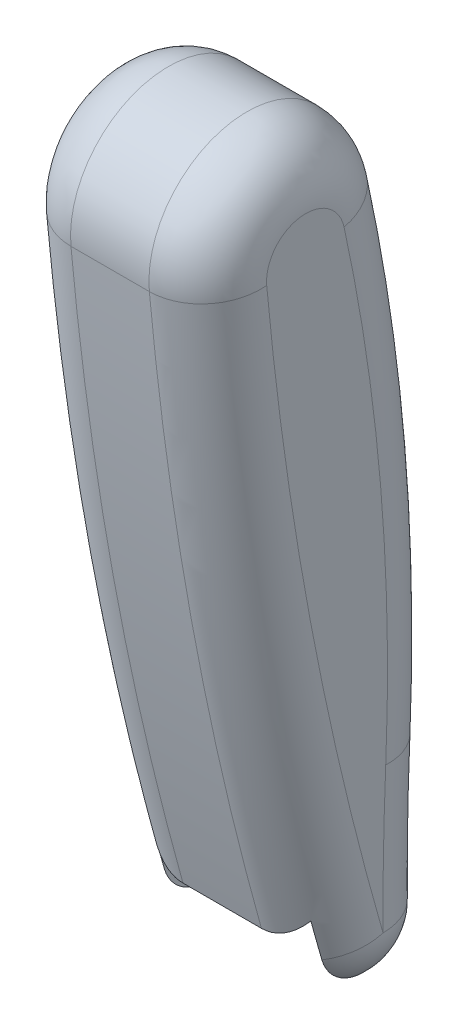
ISO-10303-21;
HEADER;
FILE_DESCRIPTION(('STEP AP214'),'2;1');
FILE_NAME('part.step','',(''),(''),'','','');
FILE_SCHEMA(('AUTOMOTIVE_DESIGN { 1 0 10303 214 1 1 1 1 }'));
ENDSEC;
DATA;
#1=APPLICATION_CONTEXT('core data for automotive mechanical design processes');
#2=APPLICATION_PROTOCOL_DEFINITION('international standard','automotive_design',2000,#1);
#3=PRODUCT_CONTEXT('',#1,'mechanical');
#4=PRODUCT('Part','Part','',(#3));
#5=PRODUCT_RELATED_PRODUCT_CATEGORY('part','',(#4));
#6=PRODUCT_DEFINITION_FORMATION('','',#4);
#7=PRODUCT_DEFINITION_CONTEXT('part definition',#1,'design');
#8=PRODUCT_DEFINITION('design','',#6,#7);
#9=PRODUCT_DEFINITION_SHAPE('','',#8);
#10=(LENGTH_UNIT() NAMED_UNIT(*) SI_UNIT(.MILLI.,.METRE.));
#11=(NAMED_UNIT(*) PLANE_ANGLE_UNIT() SI_UNIT($,.RADIAN.));
#12=(NAMED_UNIT(*) SI_UNIT($,.STERADIAN.) SOLID_ANGLE_UNIT());
#13=UNCERTAINTY_MEASURE_WITH_UNIT(LENGTH_MEASURE(1.E-05),#10,'distance_accuracy_value','');
#14=(GEOMETRIC_REPRESENTATION_CONTEXT(3) GLOBAL_UNCERTAINTY_ASSIGNED_CONTEXT((#13)) GLOBAL_UNIT_ASSIGNED_CONTEXT((#10,
#11,#12)) REPRESENTATION_CONTEXT('',''));
#15=CARTESIAN_POINT('',(0.,0.,0.));
#16=DIRECTION('',(0.,0.,1.));
#17=DIRECTION('',(1.,0.,0.));
#18=AXIS2_PLACEMENT_3D('',#15,#16,#17);
#19=CARTESIAN_POINT('',(139.699999999998,-1012.18416138642,1203.08834154745));
#20=DIRECTION('',(-1.,0.,0.));
#21=DIRECTION('',(0.,0.,1.));
#22=AXIS2_PLACEMENT_3D('',#19,#20,#21);
#23=TOROIDAL_SURFACE('',#22,1231.9,38.1);
#24=CARTESIAN_POINT('',(139.699999999999,-750.312913689883,-0.656257455955545));
#25=DIRECTION('',(0.,0.97714473496499,0.212575085393842));
#26=DIRECTION('',(0.,0.212575085393842,-0.97714473496499));
#27=AXIS2_PLACEMENT_3D('',#24,#25,#26);
#28=CIRCLE('',#27,38.1000000000001);
#29=CARTESIAN_POINT('',(177.8,-750.312913689885,-0.656257455955741));
#30=VERTEX_POINT('',#29);
#31=CARTESIAN_POINT('',(139.7,-742.213802936382,-37.8854718581219));
#32=VERTEX_POINT('',#31);
#33=EDGE_CURVE('E254',#30,#32,#28,.T.);
#34=ORIENTED_EDGE('',*,*,#33,.F.);
#35=CARTESIAN_POINT('',(177.799999999998,-1012.18416138642,1203.08834154745));
#36=DIRECTION('',(-1.,0.,0.));
#37=DIRECTION('',(0.,0.,1.));
#38=AXIS2_PLACEMENT_3D('',#35,#36,#37);
#39=CIRCLE('',#38,1231.9);
#40=CARTESIAN_POINT('',(177.799999999964,-1065.63335894836,-27.6515957585587));
#41=VERTEX_POINT('',#40);
#42=EDGE_CURVE('E424',#41,#30,#39,.F.);
#43=ORIENTED_EDGE('',*,*,#42,.F.);
#44=CARTESIAN_POINT('',(139.7,-1065.63335894836,-27.6515957585584));
#45=DIRECTION('',(0.,-0.999058314234925,0.0433876106517766));
#46=DIRECTION('',(0.,-0.0433876106517766,-0.999058314234925));
#47=AXIS2_PLACEMENT_3D('',#44,#45,#46);
#48=CIRCLE('',#47,38.1);
#49=CARTESIAN_POINT('',(139.7,-1067.28642691419,-65.7157175309086));
#50=VERTEX_POINT('',#49);
#51=EDGE_CURVE('E407',#50,#41,#48,.T.);
#52=ORIENTED_EDGE('',*,*,#51,.F.);
#53=CARTESIAN_POINT('',(139.7,-1012.18416138642,1203.08834154745));
#54=DIRECTION('',(-1.,0.,0.));
#55=DIRECTION('',(0.,0.,1.));
#56=AXIS2_PLACEMENT_3D('',#53,#54,#55);
#57=CIRCLE('',#56,1270.);
#58=EDGE_CURVE('E251',#32,#50,#57,.T.);
#59=ORIENTED_EDGE('',*,*,#58,.F.);
#60=EDGE_LOOP('',(#34,#43,#52,#59));
#61=FACE_BOUND('',#60,.T.);
#62=ADVANCED_FACE('F16',(#61),#23,.T.);
#63=CARTESIAN_POINT('',(139.699999999823,-1147.29470222544,-1908.01427826088));
#64=DIRECTION('',(-1.,0.,0.));
#65=DIRECTION('',(0.,0.,1.));
#66=AXIS2_PLACEMENT_3D('',#63,#64,#65);
#67=TOROIDAL_SURFACE('',#66,1882.13506229844,38.1);
#68=CARTESIAN_POINT('',(139.7,-1147.29470222544,-1908.01427826088));
#69=DIRECTION('',(-1.,0.,0.));
#70=DIRECTION('',(0.,0.,1.));
#71=AXIS2_PLACEMENT_3D('',#68,#69,#70);
#72=CIRCLE('',#71,1844.03506229844);
#73=CARTESIAN_POINT('',(139.7,-1143.77779359425,-63.9825696561486));
#74=VERTEX_POINT('',#73);
#75=EDGE_CURVE('E238',#74,#50,#72,.T.);
#76=ORIENTED_EDGE('',*,*,#75,.T.);
#77=ORIENTED_EDGE('',*,*,#51,.T.);
#78=CARTESIAN_POINT('',(177.799999999823,-1147.29470222544,-1908.01427826089));
#79=DIRECTION('',(-1.,0.,0.));
#80=DIRECTION('',(0.,0.,1.));
#81=AXIS2_PLACEMENT_3D('',#78,#79,#80);
#82=CIRCLE('',#81,1882.13506229845);
#83=CARTESIAN_POINT('',(177.8,-1159.01501246859,-25.9157082967679));
#84=VERTEX_POINT('',#83);
#85=EDGE_CURVE('E422',#84,#41,#82,.T.);
#86=ORIENTED_EDGE('',*,*,#85,.F.);
#87=CARTESIAN_POINT('',(139.7,-1159.01501246858,-25.9157082967631));
#88=DIRECTION('',(0.,-0.999980611203171,-0.00622713559615814));
#89=DIRECTION('',(0.,0.00622713559615814,-0.999980611203171));
#90=AXIS2_PLACEMENT_3D('',#87,#88,#89);
#91=CIRCLE('',#90,38.1000000000005);
#92=CARTESIAN_POINT('',(165.300000000002,-1158.83929576584,-54.1330633046375));
#93=VERTEX_POINT('',#92);
#94=EDGE_CURVE('E443',#93,#84,#91,.T.);
#95=ORIENTED_EDGE('',*,*,#94,.F.);
#96=CARTESIAN_POINT('',(165.299999999826,-1147.29470222544,-1908.01427826089));
#97=DIRECTION('',(-1.,0.,0.));
#98=DIRECTION('',(0.,0.,1.));
#99=AXIS2_PLACEMENT_3D('',#96,#97,#98);
#100=CIRCLE('',#99,1853.9171601794);
#101=CARTESIAN_POINT('',(165.299999999999,-1132.84478224949,-54.1534321830755));
#102=VERTEX_POINT('',#101);
#103=EDGE_CURVE('E240',#93,#102,#100,.T.);
#104=ORIENTED_EDGE('',*,*,#103,.T.);
#105=CARTESIAN_POINT('',(165.3,-1132.84478224948,-54.1534321830756));
#106=CARTESIAN_POINT('',(165.224894464453,-1132.91769230335,-54.2210010316637));
#107=CARTESIAN_POINT('',(165.14960803641,-1132.99075868789,-54.2881942542361));
#108=CARTESIAN_POINT('',(164.998673395389,-1133.13720411823,-54.4218294472956));
#109=CARTESIAN_POINT('',(164.923025182413,-1133.21058316403,-54.4882714177833));
#110=CARTESIAN_POINT('',(164.84719607694,-1133.28411854049,-54.5543377622558));
#111=B_SPLINE_CURVE_WITH_KNOTS('',3,(#105,#106,#107,#108,#109,#110),.UNSPECIFIED.,.F.,.F.,(4,2,
4),(0.,0.373758006747914,0.747516013194476),.UNSPECIFIED.);
#112=CARTESIAN_POINT('',(164.84719607694,-1133.28411854049,-54.5543377622558));
#113=VERTEX_POINT('',#112);
#114=EDGE_CURVE('E78',#102,#113,#111,.T.);
#115=ORIENTED_EDGE('',*,*,#114,.T.);
#116=CARTESIAN_POINT('',(164.84719607694,-1133.28411854049,-54.5543377622557));
#117=CARTESIAN_POINT('',(164.533876396781,-1133.58795066028,-54.82732121824));
#118=CARTESIAN_POINT('',(164.214103630313,-1133.88807683782,-55.0969750034753));
#119=CARTESIAN_POINT('',(163.561382283566,-1134.48035818339,-55.6291208764792));
#120=CARTESIAN_POINT('',(163.22843192255,-1134.77251226505,-55.8916119881759));
#121=CARTESIAN_POINT('',(162.208560106735,-1135.63688565413,-56.6682238723202));
#122=CARTESIAN_POINT('',(161.501520597084,-1136.19613594311,-57.1706923959107));
#123=CARTESIAN_POINT('',(160.024647238128,-1137.28013165982,-58.1446279272469));
#124=CARTESIAN_POINT('',(159.254176491115,-1137.804397863,-58.6156643670403));
#125=CARTESIAN_POINT('',(157.658023299389,-1138.80371027265,-59.5135146515582));
#126=CARTESIAN_POINT('',(156.83237675272,-1139.27878797852,-59.9403567974821));
#127=CARTESIAN_POINT('',(155.296802116136,-1140.08286099068,-60.6627907188103));
#128=CARTESIAN_POINT('',(154.596565724695,-1140.42210844415,-60.9675937210318));
#129=CARTESIAN_POINT('',(153.162806899049,-1141.05945677167,-61.5402308379827));
#130=CARTESIAN_POINT('',(152.429282683096,-1141.35755543974,-61.8080629707181));
#131=CARTESIAN_POINT('',(150.936474101639,-1141.90606006505,-62.3008768586865));
#132=CARTESIAN_POINT('',(150.177386219646,-1142.15676100718,-62.5261236484212));
#133=CARTESIAN_POINT('',(148.632863401683,-1142.60823882206,-62.9317620460138));
#134=CARTESIAN_POINT('',(147.84743520631,-1142.80902835838,-63.1121650316744));
#135=CARTESIAN_POINT('',(146.457750053515,-1143.11240768892,-63.3847416709853));
#136=CARTESIAN_POINT('',(145.858184875571,-1143.22698543613,-63.4876861175216));
#137=CARTESIAN_POINT('',(144.64984151933,-1143.42467547334,-63.6653043022326));
#138=CARTESIAN_POINT('',(144.04106531281,-1143.50779440125,-63.7399840043424));
#139=CARTESIAN_POINT('',(142.812061232397,-1143.64201796554,-63.8605795900917));
#140=CARTESIAN_POINT('',(142.191780557385,-1143.69285815849,-63.9062578797436));
#141=CARTESIAN_POINT('',(141.258827461262,-1143.74377839952,-63.9520080900503));
#142=CARTESIAN_POINT('',(140.947323037573,-1143.75652849192,-63.9634636408598));
#143=CARTESIAN_POINT('',(140.323888590616,-1143.77353744813,-63.9787456447904));
#144=CARTESIAN_POINT('',(140.011958557834,-1143.77779611888,-63.9825719244471));
#145=CARTESIAN_POINT('',(139.7,-1143.77779359425,-63.982569656149));
#146=B_SPLINE_CURVE_WITH_KNOTS('',3,(#116,#117,#118,#119,#120,#121,#122,#123,#124,#125,#126,
#127,#128,#129,#130,#131,#132,#133,#134,#135,#136,#137,#138,#139,#140,#141,#142,#143,#144,#145),
.UNSPECIFIED.,.F.,.F.,(4,2,2,2,2,2,2,2,2,2,2,2,2,2,4),(0.,1.54422563894035,3.08866067222214,
6.1819863832631,9.31143651375395,12.4388700439733,14.9436030037157,17.4484701891156,
19.9371942025527,22.4252861291248,24.280985032269,26.1362921595106,28.0066091579043,
28.9423544958236,29.8781211092336),.UNSPECIFIED.);
#147=EDGE_CURVE('E237',#113,#74,#146,.T.);
#148=ORIENTED_EDGE('',*,*,#147,.T.);
#149=EDGE_LOOP('',(#76,#77,#86,#95,#104,#115,#148));
#150=FACE_BOUND('',#149,.T.);
#151=ADVANCED_FACE('F396',(#150),#67,.T.);
#152=CARTESIAN_POINT('',(139.7,-1159.01501246858,-25.9157082967637));
#153=DIRECTION('',(1.,0.,0.));
#154=DIRECTION('',(0.,0.276237959534424,-0.961089272498792));
#155=AXIS2_PLACEMENT_3D('',#152,#153,#154);
#156=SPHERICAL_SURFACE('',#155,38.1000000000002);
#157=ORIENTED_EDGE('',*,*,#94,.T.);
#158=CARTESIAN_POINT('',(139.7,-1159.01501246858,-25.9157082967579));
#159=DIRECTION('',(0.,0.961089272498735,0.276237959534625));
#160=DIRECTION('',(0.,-0.276237959534625,0.961089272498735));
#161=AXIS2_PLACEMENT_3D('',#158,#159,#160);
#162=CIRCLE('',#161,38.1);
#163=CARTESIAN_POINT('',(165.3,-1166.80986817229,1.20421472227286));
#164=VERTEX_POINT('',#163);
#165=EDGE_CURVE('E375',#164,#84,#162,.T.);
#166=ORIENTED_EDGE('',*,*,#165,.F.);
#167=CARTESIAN_POINT('',(165.3,-1159.01501246858,-25.9157082967637));
#168=DIRECTION('',(1.,0.,0.));
#169=DIRECTION('',(0.,0.,-1.));
#170=AXIS2_PLACEMENT_3D('',#167,#168,#169);
#171=CIRCLE('',#170,28.217902119045);
#172=EDGE_CURVE('E253',#164,#93,#171,.T.);
#173=ORIENTED_EDGE('',*,*,#172,.T.);
#174=EDGE_LOOP('',(#157,#166,#173));
#175=FACE_BOUND('',#174,.T.);
#176=ADVANCED_FACE('F302',(#175),#156,.T.);
#177=CARTESIAN_POINT('',(177.8,-1180.44818964506,-32.6064223802156));
#178=DIRECTION('',(1.,0.,0.));
#179=DIRECTION('',(0.,0.,-1.));
#180=AXIS2_PLACEMENT_3D('',#177,#178,#179);
#181=PLANE('',#180);
#182=CARTESIAN_POINT('',(177.8,-559.109035747241,-2113.11328138226));
#183=DIRECTION('',(-1.,0.,0.));
#184=DIRECTION('',(0.,0.,1.));
#185=AXIS2_PLACEMENT_3D('',#182,#183,#184);
#186=CIRCLE('',#185,2171.69999999999);
#187=CARTESIAN_POINT('',(177.8,-758.038986954881,49.4564318322102));
#188=VERTEX_POINT('',#187);
#189=EDGE_CURVE('E231',#84,#188,#186,.T.);
#190=ORIENTED_EDGE('',*,*,#189,.F.);
#191=ORIENTED_EDGE('',*,*,#85,.T.);
#192=ORIENTED_EDGE('',*,*,#42,.T.);
#193=CARTESIAN_POINT('',(177.799999999999,-755.712320858889,24.1632188121578));
#194=DIRECTION('',(-1.,0.,0.));
#195=DIRECTION('',(0.,1.,0.));
#196=AXIS2_PLACEMENT_3D('',#193,#194,#195);
#197=CIRCLE('',#196,25.4000000000042);
#198=CARTESIAN_POINT('',(177.8,-730.312320858886,24.1632188121578));
#199=VERTEX_POINT('',#198);
#200=EDGE_CURVE('E420',#199,#30,#197,.T.);
#201=ORIENTED_EDGE('',*,*,#200,.F.);
#202=CARTESIAN_POINT('',(177.799999999999,-755.712320858889,24.1632188121578));
#203=DIRECTION('',(-1.,0.,0.));
#204=DIRECTION('',(0.,-0.0916010274012766,0.995795788191048));
#205=AXIS2_PLACEMENT_3D('',#202,#203,#204);
#206=CIRCLE('',#205,25.3999999999999);
#207=EDGE_CURVE('E418',#188,#199,#206,.T.);
#208=ORIENTED_EDGE('',*,*,#207,.F.);
#209=EDGE_LOOP('',(#190,#191,#192,#201,#208));
#210=FACE_BOUND('',#209,.T.);
#211=ADVANCED_FACE('F270',(#210),#181,.T.);
#212=CARTESIAN_POINT('',(139.7,-730.312320858885,24.1632188121577));
#213=DIRECTION('',(0.,0.,1.));
#214=DIRECTION('',(0.,1.,0.));
#215=AXIS2_PLACEMENT_3D('',#212,#213,#214);
#216=CIRCLE('',#215,38.1000000000001);
#217=TRIMMED_CURVE('',#216,(PARAMETER_VALUE(-2.30052398302195)),
(PARAMETER_VALUE(2.30052398302195)),.T.,.PARAMETER.);
#218=CARTESIAN_POINT('',(139.699999999999,-755.712320858888,24.1632188121577));
#219=DIRECTION('',(1.,0.,0.));
#220=AXIS1_PLACEMENT('',#218,#219);
#221=SURFACE_OF_REVOLUTION('',#217,#220);
#222=ORIENTED_EDGE('',*,*,#200,.T.);
#223=ORIENTED_EDGE('',*,*,#33,.T.);
#224=CARTESIAN_POINT('',(139.7,-755.712320858886,24.1632188121575));
#225=DIRECTION('',(-1.,0.,0.));
#226=DIRECTION('',(0.,0.,1.));
#227=AXIS2_PLACEMENT_3D('',#224,#225,#226);
#228=CIRCLE('',#227,63.5000000000009);
#229=CARTESIAN_POINT('',(139.7,-761.528986098875,87.3962513622887));
#230=VERTEX_POINT('',#229);
#231=EDGE_CURVE('E230',#230,#32,#228,.T.);
#232=ORIENTED_EDGE('',*,*,#231,.F.);
#233=CARTESIAN_POINT('',(139.7,-758.038986954881,49.4564318322102));
#234=DIRECTION('',(0.,-0.995795788191036,-0.0916010274014078));
#235=DIRECTION('',(0.,0.0916010274014078,-0.995795788191036));
#236=AXIS2_PLACEMENT_3D('',#233,#234,#235);
#237=CIRCLE('',#236,38.1);
#238=EDGE_CURVE('E228',#188,#230,#237,.T.);
#239=ORIENTED_EDGE('',*,*,#238,.F.);
#240=ORIENTED_EDGE('',*,*,#207,.T.);
#241=EDGE_LOOP('',(#222,#223,#232,#239,#240));
#242=FACE_BOUND('',#241,.T.);
#243=ADVANCED_FACE('F264',(#242),#221,.F.);
#244=CARTESIAN_POINT('',(177.8,-1012.18416138642,1203.08834154745));
#245=DIRECTION('',(-1.,0.,0.));
#246=DIRECTION('',(0.,0.,1.));
#247=AXIS2_PLACEMENT_3D('',#244,#245,#246);
#248=CYLINDRICAL_SURFACE('',#247,1270.);
#249=DIRECTION('',(-1.,0.,0.));
#250=VECTOR('',#249,1.);
#251=CARTESIAN_POINT('',(177.8,-742.213802936384,-37.8854718581218));
#252=LINE('',#251,#250);
#253=CARTESIAN_POINT('',(88.8999999999992,-742.213802936384,-37.8854718581229));
#254=VERTEX_POINT('',#253);
#255=EDGE_CURVE('E244',#32,#254,#252,.T.);
#256=ORIENTED_EDGE('',*,*,#255,.F.);
#257=ORIENTED_EDGE('',*,*,#58,.T.);
#258=DIRECTION('',(-1.,0.,0.));
#259=VECTOR('',#258,1.);
#260=CARTESIAN_POINT('',(177.8,-1067.28642691419,-65.7157175309087));
#261=LINE('',#260,#259);
#262=CARTESIAN_POINT('',(88.9000000000001,-1067.28642691419,-65.7157175309087));
#263=VERTEX_POINT('',#262);
#264=EDGE_CURVE('E87',#50,#263,#261,.T.);
#265=ORIENTED_EDGE('',*,*,#264,.T.);
#266=CARTESIAN_POINT('',(88.9000000000001,-1012.18416138642,1203.08834154745));
#267=DIRECTION('',(-1.,0.,0.));
#268=DIRECTION('',(0.,0.,1.));
#269=AXIS2_PLACEMENT_3D('',#266,#267,#268);
#270=CIRCLE('',#269,1270.);
#271=EDGE_CURVE('E175',#254,#263,#270,.T.);
#272=ORIENTED_EDGE('',*,*,#271,.F.);
#273=EDGE_LOOP('',(#256,#257,#265,#272));
#274=FACE_BOUND('',#273,.T.);
#275=ADVANCED_FACE('F269',(#274),#248,.T.);
#276=CARTESIAN_POINT('',(165.3,-1159.01501246857,-25.9157082967632));
#277=DIRECTION('',(1.,0.,0.));
#278=DIRECTION('',(0.,0.,-1.));
#279=AXIS2_PLACEMENT_3D('',#276,#277,#278);
#280=PLANE('',#279);
#281=ORIENTED_EDGE('',*,*,#103,.F.);
#282=ORIENTED_EDGE('',*,*,#172,.F.);
#283=CARTESIAN_POINT('',(165.3,-559.109035747241,-2113.11328138226));
#284=DIRECTION('',(-1.,0.,0.));
#285=DIRECTION('',(0.,0.,1.));
#286=AXIS2_PLACEMENT_3D('',#283,#284,#285);
#287=CIRCLE('',#286,2199.91790211904);
#288=CARTESIAN_POINT('',(165.3,-1141.4312152961,8.33425633091922));
#289=VERTEX_POINT('',#288);
#290=EDGE_CURVE('E379',#289,#164,#287,.F.);
#291=ORIENTED_EDGE('',*,*,#290,.F.);
#292=CARTESIAN_POINT('',(165.3,-1159.01501246857,-25.9157082967632));
#293=DIRECTION('',(1.,0.,0.));
#294=DIRECTION('',(0.,0.,-1.));
#295=AXIS2_PLACEMENT_3D('',#292,#293,#294);
#296=CIRCLE('',#295,38.5);
#297=EDGE_CURVE('E140',#289,#102,#296,.F.);
#298=ORIENTED_EDGE('',*,*,#297,.T.);
#299=EDGE_LOOP('',(#281,#282,#291,#298));
#300=FACE_BOUND('',#299,.T.);
#301=ADVANCED_FACE('F458',(#300),#280,.F.);
#302=CARTESIAN_POINT('',(177.8,-1147.29470222544,-1908.01427826088));
#303=DIRECTION('',(-1.,0.,0.));
#304=DIRECTION('',(0.,0.,1.));
#305=AXIS2_PLACEMENT_3D('',#302,#303,#304);
#306=CYLINDRICAL_SURFACE('',#305,1844.03506229844);
#307=DIRECTION('',(1.,0.,0.));
#308=VECTOR('',#307,1.);
#309=CARTESIAN_POINT('',(63.3000000000001,-1143.77779359425,-63.9825696561482));
#310=LINE('',#309,#308);
#311=CARTESIAN_POINT('',(88.9000000000001,-1143.77779359425,-63.9825696561487));
#312=VERTEX_POINT('',#311);
#313=EDGE_CURVE('E235',#74,#312,#310,.F.);
#314=ORIENTED_EDGE('',*,*,#313,.T.);
#315=CARTESIAN_POINT('',(88.8999999999117,-1147.29470222545,-1908.01427826092));
#316=DIRECTION('',(1.,0.,0.));
#317=DIRECTION('',(0.,0.,-1.));
#318=AXIS2_PLACEMENT_3D('',#315,#316,#317);
#319=CIRCLE('',#318,1844.03506229848);
#320=EDGE_CURVE('E166',#263,#312,#319,.T.);
#321=ORIENTED_EDGE('',*,*,#320,.F.);
#322=ORIENTED_EDGE('',*,*,#264,.F.);
#323=ORIENTED_EDGE('',*,*,#75,.F.);
#324=EDGE_LOOP('',(#314,#321,#322,#323));
#325=FACE_BOUND('',#324,.T.);
#326=ADVANCED_FACE('F538',(#325),#306,.F.);
#327=CARTESIAN_POINT('',(63.3000000000001,-1133.28411854049,-54.5543377622557));
#328=DIRECTION('',(0.,0.668334907222924,-0.743860505597203));
#329=DIRECTION('',(0.,0.743860505597203,0.668334907222924));
#330=AXIS2_PLACEMENT_3D('',#327,#328,#329);
#331=PLANE('',#330);
#332=DIRECTION('',(1.,0.,0.));
#333=VECTOR('',#332,1.);
#334=CARTESIAN_POINT('',(63.3000000000001,-1133.28411854049,-54.5543377622557));
#335=LINE('',#334,#333);
#336=CARTESIAN_POINT('',(63.7528039230599,-1133.28411854049,-54.5543377622557));
#337=VERTEX_POINT('',#336);
#338=EDGE_CURVE('E129',#113,#337,#335,.F.);
#339=ORIENTED_EDGE('',*,*,#338,.T.);
#340=CARTESIAN_POINT('',(88.9000000000001,-1143.77779359425,-63.9825696561492));
#341=CARTESIAN_POINT('',(88.4840696853345,-1143.7778100078,-63.9825844032005));
#342=CARTESIAN_POINT('',(88.0681487985103,-1143.7702293869,-63.9757734574281));
#343=CARTESIAN_POINT('',(87.2373229266043,-1143.73999680552,-63.9486104486099));
#344=CARTESIAN_POINT('',(86.8224178803993,-1143.71734577536,-63.9282592214329));
#345=CARTESIAN_POINT('',(85.994951512664,-1143.6571229051,-63.8741508958752));
#346=CARTESIAN_POINT('',(85.5823883801559,-1143.61956486749,-63.8404061985903));
#347=CARTESIAN_POINT('',(84.7601903965543,-1143.52977846206,-63.7597359808686));
#348=CARTESIAN_POINT('',(84.350555566324,-1143.47754998983,-63.7128103666181));
#349=CARTESIAN_POINT('',(83.1376591254139,-1143.30079730004,-63.5540037198808));
#350=CARTESIAN_POINT('',(82.3397202940009,-1143.1554125384,-63.4233801547729));
#351=CARTESIAN_POINT('',(80.7647836629618,-1142.81179986679,-63.1146551434671));
#352=CARTESIAN_POINT('',(79.9877893041959,-1142.61356333163,-62.9365459478133));
#353=CARTESIAN_POINT('',(78.4624275309089,-1142.16908270417,-62.5371942996433));
#354=CARTESIAN_POINT('',(77.7139647063671,-1141.92301922921,-62.3161141260487));
#355=CARTESIAN_POINT('',(76.24629684964,-1141.38677474597,-61.8343155841764));
#356=CARTESIAN_POINT('',(75.5270919747669,-1141.09659350053,-61.5735970028093));
#357=CARTESIAN_POINT('',(74.1165582561529,-1140.47484901374,-61.0149794384102));
#358=CARTESIAN_POINT('',(73.4254035431442,-1140.14306795688,-60.7168847550768));
#359=CARTESIAN_POINT('',(72.0767367593606,-1139.44376323534,-60.0885817968275));
#360=CARTESIAN_POINT('',(71.4192238235223,-1139.07624049043,-59.7583743482919));
#361=CARTESIAN_POINT('',(70.1177825759475,-1138.29707199055,-59.0583163358603));
#362=CARTESIAN_POINT('',(69.4749879202102,-1137.88438127618,-58.6875269093143));
#363=CARTESIAN_POINT('',(68.2261142798753,-1137.0292332736,-57.9192037402944));
#364=CARTESIAN_POINT('',(67.6200426613359,-1136.58677005081,-57.5216646657943));
#365=CARTESIAN_POINT('',(66.4500078739035,-1135.68009750501,-56.7070483402648));
#366=CARTESIAN_POINT('',(65.8857025124624,-1135.21613161859,-56.2901898092298));
#367=CARTESIAN_POINT('',(64.7927757849606,-1134.26604324757,-55.4365657513339));
#368=CARTESIAN_POINT('',(64.2641293512756,-1133.77993673881,-54.9998145782479));
#369=CARTESIAN_POINT('',(63.75280392306,-1133.28411854049,-54.5543377622555));
#370=B_SPLINE_CURVE_WITH_KNOTS('',3,(#340,#341,#342,#343,#344,#345,#346,#347,#348,#349,#350,
#351,#352,#353,#354,#355,#356,#357,#358,#359,#360,#361,#362,#363,#364,#365,#366,#367,#368,#369),
.UNSPECIFIED.,.F.,.F.,(4,2,2,2,2,2,2,2,2,2,2,2,2,2,4),(0.,1.2476495926101,2.49522217245733,
3.74164230192639,4.9880713028892,7.44884429561219,9.91001912226155,12.362073895673,
14.8141418513824,17.279631507753,19.7450577347258,22.2905077337207,24.8364666307889,
27.3584996802682,29.8787408966437),.UNSPECIFIED.);
#371=EDGE_CURVE('E160',#312,#337,#370,.T.);
#372=ORIENTED_EDGE('',*,*,#371,.F.);
#373=ORIENTED_EDGE('',*,*,#313,.F.);
#374=ORIENTED_EDGE('',*,*,#147,.F.);
#375=EDGE_LOOP('',(#339,#372,#373,#374));
#376=FACE_BOUND('',#375,.T.);
#377=ADVANCED_FACE('F301',(#376),#331,.F.);
#378=CARTESIAN_POINT('',(139.7,-559.109035747241,-2113.11328138226));
#379=DIRECTION('',(-1.,0.,0.));
#380=DIRECTION('',(0.,0.,1.));
#381=AXIS2_PLACEMENT_3D('',#378,#379,#380);
#382=TOROIDAL_SURFACE('',#381,2171.69999999999,38.1);
#383=ORIENTED_EDGE('',*,*,#238,.T.);
#384=CARTESIAN_POINT('',(139.7,-559.10903574724,-2113.11328138226));
#385=DIRECTION('',(-1.,0.,0.));
#386=DIRECTION('',(0.,0.,1.));
#387=AXIS2_PLACEMENT_3D('',#384,#385,#386);
#388=CIRCLE('',#387,2209.8);
#389=CARTESIAN_POINT('',(139.7,-1155.10935951109,14.796409857802));
#390=VERTEX_POINT('',#389);
#391=EDGE_CURVE('E149',#390,#230,#388,.T.);
#392=ORIENTED_EDGE('',*,*,#391,.F.);
#393=CARTESIAN_POINT('',(139.7,-1155.10935951109,14.7964098578024));
#394=CARTESIAN_POINT('',(140.109054143052,-1155.10937955412,14.7964192899969));
#395=CARTESIAN_POINT('',(140.51809882173,-1155.10024677847,14.7921214312863));
#396=CARTESIAN_POINT('',(141.335174630119,-1155.063825474,14.7749816671487));
#397=CARTESIAN_POINT('',(141.743205822469,-1155.03653809676,14.7621403036426));
#398=CARTESIAN_POINT('',(142.55692589675,-1154.96399187597,14.7280002547928));
#399=CARTESIAN_POINT('',(142.962616633991,-1154.91875011111,14.7067096066334));
#400=CARTESIAN_POINT('',(143.771078746594,-1154.81060090185,14.6558148908655));
#401=CARTESIAN_POINT('',(144.173850100661,-1154.74769332871,14.6262107626741));
#402=CARTESIAN_POINT('',(145.366124332415,-1154.53485363611,14.5260489978962));
#403=CARTESIAN_POINT('',(146.150325564011,-1154.35982768093,14.4436822723167));
#404=CARTESIAN_POINT('',(147.69788671901,-1153.94624962515,14.2490535945845));
#405=CARTESIAN_POINT('',(148.461243133645,-1153.70768690133,14.1367866431691));
#406=CARTESIAN_POINT('',(149.959453897125,-1153.17294472709,13.8851384697559));
#407=CARTESIAN_POINT('',(150.694405702837,-1152.8769881152,13.7458621149439));
#408=CARTESIAN_POINT('',(152.135273620721,-1152.23218725307,13.4424206304523));
#409=CARTESIAN_POINT('',(152.84118954644,-1151.88334266328,13.2782553409813));
#410=CARTESIAN_POINT('',(154.225425291485,-1151.13609458218,12.9266024814232));
#411=CARTESIAN_POINT('',(154.903570123116,-1150.73742667423,12.738990477606));
#412=CARTESIAN_POINT('',(156.226600084272,-1149.89740081429,12.3436766544995));
#413=CARTESIAN_POINT('',(156.871486213571,-1149.45604414669,12.1359754396434));
#414=CARTESIAN_POINT('',(158.137808993719,-1148.52793178954,11.6992083570159));
#415=CARTESIAN_POINT('',(158.758677286127,-1148.04054314308,11.4698446214902));
#416=CARTESIAN_POINT('',(159.96541717524,-1147.03140080928,10.9949450582045));
#417=CARTESIAN_POINT('',(160.551282251273,-1146.5096407568,10.7494062350247));
#418=CARTESIAN_POINT('',(161.682837068077,-1145.4412128279,10.2466070362999));
#419=CARTESIAN_POINT('',(162.228856468144,-1144.89482970633,9.98948066559079));
#420=CARTESIAN_POINT('',(163.28712162765,-1143.77653417545,9.46321391267469));
#421=CARTESIAN_POINT('',(163.799390446187,-1143.20463965361,9.19408194826382));
#422=CARTESIAN_POINT('',(164.295322640254,-1142.62157071375,8.91969133394447));
#423=B_SPLINE_CURVE_WITH_KNOTS('',3,(#393,#394,#395,#396,#397,#398,#399,#400,#401,#402,#403,
#404,#405,#406,#407,#408,#409,#410,#411,#412,#413,#414,#415,#416,#417,#418,#419,#420,#421,#422),
.UNSPECIFIED.,.F.,.F.,(4,2,2,2,2,2,2,2,2,2,2,2,2,2,4),(0.,1.22702134636938,2.45396486925785,
3.67974407759616,4.90553221882367,7.32486397466093,9.74460049253435,12.1551236853854,
14.5656623549001,16.9895853189355,19.4134353759877,21.8775965376867,24.3422153204029,
26.7833465288043,29.2227922296927),.UNSPECIFIED.);
#424=CARTESIAN_POINT('',(164.295322640254,-1142.62157071375,8.91969133394451));
#425=VERTEX_POINT('',#424);
#426=EDGE_CURVE('E145',#390,#425,#423,.T.);
#427=ORIENTED_EDGE('',*,*,#426,.T.);
#428=CARTESIAN_POINT('',(164.295322640254,-1142.62157071375,8.91969133394444));
#429=CARTESIAN_POINT('',(164.338149614234,-1142.57121523536,8.89599418311803));
#430=CARTESIAN_POINT('',(164.380923357502,-1142.5208740827,8.87217037518478));
#431=CARTESIAN_POINT('',(164.466209221334,-1142.42040306847,8.82435521619928));
#432=CARTESIAN_POINT('',(164.508721728972,-1142.37027310003,8.80036478009972));
#433=CARTESIAN_POINT('',(164.593485433845,-1142.27022498646,8.75221837853125));
#434=CARTESIAN_POINT('',(164.635737019965,-1142.22030673132,8.72806332634483));
#435=CARTESIAN_POINT('',(164.719979204883,-1142.12068257842,8.67958969437972));
#436=CARTESIAN_POINT('',(164.761970194356,-1142.07097656745,8.65527202622938));
#437=CARTESIAN_POINT('',(164.845691521423,-1141.97177743227,8.60647515554216));
#438=CARTESIAN_POINT('',(164.887422251454,-1141.92228419166,8.58199686298327));
#439=CARTESIAN_POINT('',(164.970623406743,-1141.8235111241,8.53288072692134));
#440=CARTESIAN_POINT('',(165.012094226174,-1141.7742311775,8.508243791754));
#441=CARTESIAN_POINT('',(165.094775919491,-1141.67588522015,8.45881234530961));
#442=CARTESIAN_POINT('',(165.135987189259,-1141.6268190865,8.43401874072979));
#443=CARTESIAN_POINT('',(165.218150152717,-1141.52890127928,8.38427591803319));
#444=CARTESIAN_POINT('',(165.259102243977,-1141.48004947953,8.35932760499225));
#445=CARTESIAN_POINT('',(165.3,-1141.43121529611,8.33425633091922));
#446=B_SPLINE_CURVE_WITH_KNOTS('',3,(#428,#429,#430,#431,#432,#433,#434,#435,#436,#437,#438,
#439,#440,#441,#442,#443,#444,#445),.UNSPECIFIED.,.F.,.F.,(4,2,2,2,2,2,2,2,4),(0.,
0.210671201760832,0.420582099028562,0.629733313233976,0.838125472410648,1.04575921125937,
1.25263517123901,1.45875400062802,1.66411635462513),.UNSPECIFIED.);
#447=EDGE_CURVE('E133',#425,#289,#446,.T.);
#448=ORIENTED_EDGE('',*,*,#447,.T.);
#449=ORIENTED_EDGE('',*,*,#290,.T.);
#450=ORIENTED_EDGE('',*,*,#165,.T.);
#451=ORIENTED_EDGE('',*,*,#189,.T.);
#452=EDGE_LOOP('',(#383,#392,#427,#448,#449,#450,#451));
#453=FACE_BOUND('',#452,.T.);
#454=ADVANCED_FACE('F147',(#453),#382,.T.);
#455=CARTESIAN_POINT('',(177.8,-755.712320858886,24.1632188121575));
#456=DIRECTION('',(-1.,0.,0.));
#457=DIRECTION('',(0.,0.,1.));
#458=AXIS2_PLACEMENT_3D('',#455,#456,#457);
#459=CYLINDRICAL_SURFACE('',#458,63.5000000000009);
#460=ORIENTED_EDGE('',*,*,#255,.T.);
#461=CARTESIAN_POINT('',(88.9000000000004,-755.712320858889,24.1632188121581));
#462=DIRECTION('',(1.,0.,0.));
#463=DIRECTION('',(0.,1.,0.));
#464=AXIS2_PLACEMENT_3D('',#461,#462,#463);
#465=CIRCLE('',#464,63.5000000000041);
#466=CARTESIAN_POINT('',(88.9000000000001,-761.528986098875,87.3962513622897));
#467=VERTEX_POINT('',#466);
#468=EDGE_CURVE('E215',#467,#254,#465,.F.);
#469=ORIENTED_EDGE('',*,*,#468,.F.);
#470=DIRECTION('',(-1.,0.,0.));
#471=VECTOR('',#470,1.);
#472=CARTESIAN_POINT('',(177.8,-761.528986098875,87.3962513622884));
#473=LINE('',#472,#471);
#474=EDGE_CURVE('E213',#230,#467,#473,.T.);
#475=ORIENTED_EDGE('',*,*,#474,.F.);
#476=ORIENTED_EDGE('',*,*,#231,.T.);
#477=EDGE_LOOP('',(#460,#469,#475,#476));
#478=FACE_BOUND('',#477,.T.);
#479=ADVANCED_FACE('F300',(#478),#459,.T.);
#480=CARTESIAN_POINT('',(88.9000000000001,-1012.18416138642,1203.08834154745));
#481=DIRECTION('',(-1.,0.,0.));
#482=DIRECTION('',(0.,0.,1.));
#483=AXIS2_PLACEMENT_3D('',#480,#481,#482);
#484=TOROIDAL_SURFACE('',#483,1231.9,38.1);
#485=CARTESIAN_POINT('',(88.9000000000001,-1065.63335894836,-27.6515957585584));
#486=DIRECTION('',(0.,-0.999058314234924,0.0433876106517865));
#487=DIRECTION('',(0.,-0.0433876106517865,-0.999058314234924));
#488=AXIS2_PLACEMENT_3D('',#485,#486,#487);
#489=CIRCLE('',#488,38.1);
#490=CARTESIAN_POINT('',(50.7999999999822,-1065.63335894836,-27.6515957585581));
#491=VERTEX_POINT('',#490);
#492=EDGE_CURVE('E169',#491,#263,#489,.T.);
#493=ORIENTED_EDGE('',*,*,#492,.F.);
#494=CARTESIAN_POINT('',(50.8000000000001,-1012.18416138642,1203.08834154745));
#495=DIRECTION('',(-1.,0.,0.));
#496=DIRECTION('',(0.,0.,1.));
#497=AXIS2_PLACEMENT_3D('',#494,#495,#496);
#498=CIRCLE('',#497,1231.9);
#499=CARTESIAN_POINT('',(50.7999999999997,-750.312913689885,-0.656257455955184));
#500=VERTEX_POINT('',#499);
#501=EDGE_CURVE('E220',#500,#491,#498,.T.);
#502=ORIENTED_EDGE('',*,*,#501,.F.);
#503=CARTESIAN_POINT('',(88.8999999999994,-750.312913689886,-0.656257455956877));
#504=DIRECTION('',(0.,0.977144734965005,0.212575085393774));
#505=DIRECTION('',(0.,0.212575085393774,-0.977144734965005));
#506=AXIS2_PLACEMENT_3D('',#503,#504,#505);
#507=CIRCLE('',#506,38.1000000000001);
#508=EDGE_CURVE('E172',#254,#500,#507,.T.);
#509=ORIENTED_EDGE('',*,*,#508,.F.);
#510=ORIENTED_EDGE('',*,*,#271,.T.);
#511=EDGE_LOOP('',(#493,#502,#509,#510));
#512=FACE_BOUND('',#511,.T.);
#513=ADVANCED_FACE('F304',(#512),#484,.T.);
#514=CARTESIAN_POINT('',(63.3000000000001,-1159.01501246857,-25.9157082967632));
#515=DIRECTION('',(1.,0.,0.));
#516=DIRECTION('',(0.,0.,-1.));
#517=AXIS2_PLACEMENT_3D('',#514,#515,#516);
#518=CYLINDRICAL_SURFACE('',#517,38.5);
#519=ORIENTED_EDGE('',*,*,#297,.F.);
#520=ORIENTED_EDGE('',*,*,#447,.F.);
#521=DIRECTION('',(1.,0.,0.));
#522=VECTOR('',#521,1.);
#523=CARTESIAN_POINT('',(63.3000000000001,-1142.62157071375,8.91969133394469));
#524=LINE('',#523,#522);
#525=CARTESIAN_POINT('',(64.3046773597462,-1142.62157071375,8.91969133394434));
#526=VERTEX_POINT('',#525);
#527=EDGE_CURVE('E137',#425,#526,#524,.F.);
#528=ORIENTED_EDGE('',*,*,#527,.T.);
#529=CARTESIAN_POINT('',(63.3000000000005,-1141.43121529611,8.33425633091878));
#530=CARTESIAN_POINT('',(63.340897756023,-1141.48004947953,8.35932760499237));
#531=CARTESIAN_POINT('',(63.3818498472824,-1141.52890127928,8.38427591803314));
#532=CARTESIAN_POINT('',(63.4640128107396,-1141.6268190865,8.4340187407291));
#533=CARTESIAN_POINT('',(63.505224080507,-1141.67588522015,8.45881234530846));
#534=CARTESIAN_POINT('',(63.5879057738239,-1141.7742311775,8.50824379175238));
#535=CARTESIAN_POINT('',(63.629376593255,-1141.82351112409,8.53288072691972));
#536=CARTESIAN_POINT('',(63.7125777485439,-1141.92228419165,8.58199686298173));
#537=CARTESIAN_POINT('',(63.7543084785745,-1141.97177743227,8.60647515554067));
#538=CARTESIAN_POINT('',(63.8380298056415,-1142.07097656745,8.65527202622805));
#539=CARTESIAN_POINT('',(63.8800207951144,-1142.12068257842,8.67958969437847));
#540=CARTESIAN_POINT('',(63.9642629800326,-1142.22030673132,8.72806332634343));
#541=CARTESIAN_POINT('',(64.0065145661528,-1142.27022498646,8.75221837852961));
#542=CARTESIAN_POINT('',(64.0912782710263,-1142.37027310002,8.80036478009863));
#543=CARTESIAN_POINT('',(64.1337907786653,-1142.42040306847,8.824355216199));
#544=CARTESIAN_POINT('',(64.219076642498,-1142.5208740827,8.87217037518552));
#545=CARTESIAN_POINT('',(64.261850385767,-1142.57121523535,8.89599418311898));
#546=CARTESIAN_POINT('',(64.3046773597463,-1142.62157071375,8.91969133394399));
#547=B_SPLINE_CURVE_WITH_KNOTS('',3,(#529,#530,#531,#532,#533,#534,#535,#536,#537,#538,#539,
#540,#541,#542,#543,#544,#545,#546),.UNSPECIFIED.,.F.,.F.,(4,2,2,2,2,2,2,2,4),(0.,
0.205362353994915,0.411481183382994,0.618357143360776,0.825990882210989,1.03438304138775,
1.24353425559344,1.45344515286081,1.66411635462516),.UNSPECIFIED.);
#548=CARTESIAN_POINT('',(63.3000000000003,-1141.43121529611,8.33425633091866));
#549=VERTEX_POINT('',#548);
#550=EDGE_CURVE('E38',#549,#526,#547,.T.);
#551=ORIENTED_EDGE('',*,*,#550,.F.);
#552=CARTESIAN_POINT('',(63.3000000000001,-1159.01501246857,-25.9157082967632));
#553=DIRECTION('',(1.,0.,0.));
#554=DIRECTION('',(0.,0.,-1.));
#555=AXIS2_PLACEMENT_3D('',#552,#553,#554);
#556=CIRCLE('',#555,38.5);
#557=CARTESIAN_POINT('',(63.2999999999994,-1132.84478224948,-54.1534321830756));
#558=VERTEX_POINT('',#557);
#559=EDGE_CURVE('E342',#558,#549,#556,.T.);
#560=ORIENTED_EDGE('',*,*,#559,.F.);
#561=CARTESIAN_POINT('',(63.7528039230599,-1133.28411854049,-54.5543377622556));
#562=CARTESIAN_POINT('',(63.6769748175869,-1133.21058316403,-54.4882714177832));
#563=CARTESIAN_POINT('',(63.6013266046105,-1133.13720411823,-54.4218294472956));
#564=CARTESIAN_POINT('',(63.4503919635902,-1132.99075868789,-54.2881942542362));
#565=CARTESIAN_POINT('',(63.3751055355466,-1132.91769230335,-54.2210010316638));
#566=CARTESIAN_POINT('',(63.3,-1132.84478224948,-54.1534321830756));
#567=B_SPLINE_CURVE_WITH_KNOTS('',3,(#561,#562,#563,#564,#565,#566),.UNSPECIFIED.,.F.,.F.,(4,2,
4),(0.,0.373758006446388,0.747516013194294),.UNSPECIFIED.);
#568=EDGE_CURVE('E157',#337,#558,#567,.T.);
#569=ORIENTED_EDGE('',*,*,#568,.F.);
#570=ORIENTED_EDGE('',*,*,#338,.F.);
#571=ORIENTED_EDGE('',*,*,#114,.F.);
#572=EDGE_LOOP('',(#519,#520,#528,#551,#560,#569,#570,#571));
#573=FACE_BOUND('',#572,.T.);
#574=ADVANCED_FACE('F135',(#573),#518,.F.);
#575=CARTESIAN_POINT('',(88.8999999999098,-1147.29470222545,-1908.01427826092));
#576=DIRECTION('',(-1.,0.,0.));
#577=DIRECTION('',(0.,0.,1.));
#578=AXIS2_PLACEMENT_3D('',#575,#576,#577);
#579=TOROIDAL_SURFACE('',#578,1882.13506229848,38.1);
#580=ORIENTED_EDGE('',*,*,#371,.T.);
#581=ORIENTED_EDGE('',*,*,#568,.T.);
#582=CARTESIAN_POINT('',(63.2999999999114,-1147.29470222545,-1908.01427826092));
#583=DIRECTION('',(-1.,0.,0.));
#584=DIRECTION('',(0.,0.,1.));
#585=AXIS2_PLACEMENT_3D('',#582,#583,#584);
#586=CIRCLE('',#585,1853.91716017943);
#587=CARTESIAN_POINT('',(63.3000000000016,-1158.83929607841,-54.1330633065882));
#588=VERTEX_POINT('',#587);
#589=EDGE_CURVE('E334',#588,#558,#586,.T.);
#590=ORIENTED_EDGE('',*,*,#589,.F.);
#591=CARTESIAN_POINT('',(88.9,-1159.01501246858,-25.9157082967633));
#592=DIRECTION('',(0.,-0.999980611341131,-0.00622711344188787));
#593=DIRECTION('',(0.,0.00622711344188787,-0.999980611341131));
#594=AXIS2_PLACEMENT_3D('',#591,#592,#593);
#595=CIRCLE('',#594,38.0999999999999);
#596=CARTESIAN_POINT('',(50.8000000000012,-1159.01501246857,-25.9157082967627));
#597=VERTEX_POINT('',#596);
#598=EDGE_CURVE('E344',#597,#588,#595,.T.);
#599=ORIENTED_EDGE('',*,*,#598,.F.);
#600=CARTESIAN_POINT('',(50.8000000000001,-1147.29470222545,-1908.01427825966));
#601=DIRECTION('',(-1.,0.,0.));
#602=DIRECTION('',(0.,0.,1.));
#603=AXIS2_PLACEMENT_3D('',#600,#601,#602);
#604=CIRCLE('',#603,1882.13506229723);
#605=EDGE_CURVE('E345',#491,#597,#604,.F.);
#606=ORIENTED_EDGE('',*,*,#605,.F.);
#607=ORIENTED_EDGE('',*,*,#492,.T.);
#608=ORIENTED_EDGE('',*,*,#320,.T.);
#609=EDGE_LOOP('',(#580,#581,#590,#599,#606,#607,#608));
#610=FACE_BOUND('',#609,.T.);
#611=ADVANCED_FACE('F322',(#610),#579,.T.);
#612=CARTESIAN_POINT('',(63.3000000000001,-1142.62157071375,8.91969133394469));
#613=DIRECTION('',(0.,0.425803681943536,0.904815574823582));
#614=DIRECTION('',(0.,-0.904815574823582,0.425803681943536));
#615=AXIS2_PLACEMENT_3D('',#612,#613,#614);
#616=PLANE('',#615);
#617=DIRECTION('',(-1.,0.,0.));
#618=VECTOR('',#617,1.);
#619=CARTESIAN_POINT('',(177.8,-1155.10935951109,14.7964098578015));
#620=LINE('',#619,#618);
#621=CARTESIAN_POINT('',(88.9000000000001,-1155.10935951109,14.7964098578021));
#622=VERTEX_POINT('',#621);
#623=EDGE_CURVE('E152',#622,#390,#620,.F.);
#624=ORIENTED_EDGE('',*,*,#623,.F.);
#625=CARTESIAN_POINT('',(64.3046773597461,-1142.62157071375,8.91969133394465));
#626=CARTESIAN_POINT('',(64.6108248037321,-1142.98152564279,9.08908511802972));
#627=CARTESIAN_POINT('',(64.9231489976045,-1143.33715303417,9.25644237498124));
#628=CARTESIAN_POINT('',(65.5604403715047,-1144.03908689076,9.58677048706938));
#629=CARTESIAN_POINT('',(65.8854092865689,-1144.38539206573,9.74974073501837));
#630=CARTESIAN_POINT('',(66.8805538914559,-1145.41017230458,10.2319994527344));
#631=CARTESIAN_POINT('',(67.5700769366239,-1146.07345910362,10.5441403674992));
#632=CARTESIAN_POINT('',(69.0099715655124,-1147.35972911227,11.1494554404223));
#633=CARTESIAN_POINT('',(69.7609678797784,-1147.98214095448,11.4423607146827));
#634=CARTESIAN_POINT('',(71.316474125311,-1149.16904608011,12.0009149512293));
#635=CARTESIAN_POINT('',(72.1209492874537,-1149.73357639959,12.2665813425804));
#636=CARTESIAN_POINT('',(73.6193516345566,-1150.69102620751,12.7171545475884));
#637=CARTESIAN_POINT('',(74.3039738984416,-1151.09587798085,12.9076766611843));
#638=CARTESIAN_POINT('',(75.7058632097426,-1151.85668140577,13.2657086276725));
#639=CARTESIAN_POINT('',(76.4231321201262,-1152.21263026204,13.4332171651072));
#640=CARTESIAN_POINT('',(77.8829422493577,-1152.86775063966,13.7415149847567));
#641=CARTESIAN_POINT('',(78.6252883751454,-1153.16727695599,13.8824712325068));
#642=CARTESIAN_POINT('',(80.1358930092588,-1153.70688438256,14.1364089800782));
#643=CARTESIAN_POINT('',(80.9041448934362,-1153.94698056017,14.2493975705644));
#644=CARTESIAN_POINT('',(82.2654356173039,-1154.31044867544,14.4204446502735));
#645=CARTESIAN_POINT('',(82.8538898206793,-1154.44798902712,14.4851707555615));
#646=CARTESIAN_POINT('',(84.0399371335431,-1154.68531666524,14.5968564790918));
#647=CARTESIAN_POINT('',(84.6375282903777,-1154.78511190399,14.6438198396776));
#648=CARTESIAN_POINT('',(85.8441246187144,-1154.94629037915,14.7196699798402));
#649=CARTESIAN_POINT('',(86.4531833005514,-1155.00734945123,14.748404208595));
#650=CARTESIAN_POINT('',(87.3692852830634,-1155.06850569161,14.7771841644786));
#651=CARTESIAN_POINT('',(87.6751689997384,-1155.08381906847,14.7843905968509));
#652=CARTESIAN_POINT('',(88.2873590280125,-1155.10424762677,14.7940042193224));
#653=CARTESIAN_POINT('',(88.5936653492223,-1155.10936257233,14.7964112984143));
#654=CARTESIAN_POINT('',(88.9,-1155.10935951109,14.7964098578023));
#655=B_SPLINE_CURVE_WITH_KNOTS('',3,(#625,#626,#627,#628,#629,#630,#631,#632,#633,#634,#635,
#636,#637,#638,#639,#640,#641,#642,#643,#644,#645,#646,#647,#648,#649,#650,#651,#652,#653,#654),
.UNSPECIFIED.,.F.,.F.,(4,2,2,2,2,2,2,2,2,2,2,2,2,2,4),(0.,1.50583228629484,3.01187192800476,
6.02833862533219,9.0805843407278,12.1308646962035,14.5822845034029,17.0338443756846,
19.469432382837,21.9044022592692,23.7263200921807,25.5478538602791,27.3844367887397,
28.3033111945295,29.2222068533144),.UNSPECIFIED.);
#656=EDGE_CURVE('E156',#526,#622,#655,.T.);
#657=ORIENTED_EDGE('',*,*,#656,.F.);
#658=ORIENTED_EDGE('',*,*,#527,.F.);
#659=ORIENTED_EDGE('',*,*,#426,.F.);
#660=EDGE_LOOP('',(#624,#657,#658,#659));
#661=FACE_BOUND('',#660,.T.);
#662=ADVANCED_FACE('F154',(#661),#616,.F.);
#663=CARTESIAN_POINT('',(177.8,-559.10903574724,-2113.11328138226));
#664=DIRECTION('',(-1.,0.,0.));
#665=DIRECTION('',(0.,0.,1.));
#666=AXIS2_PLACEMENT_3D('',#663,#664,#665);
#667=CYLINDRICAL_SURFACE('',#666,2209.8);
#668=ORIENTED_EDGE('',*,*,#474,.T.);
#669=CARTESIAN_POINT('',(88.8999999999954,-559.109035747241,-2113.11328138226));
#670=DIRECTION('',(-1.,0.,0.));
#671=DIRECTION('',(0.,0.,1.));
#672=AXIS2_PLACEMENT_3D('',#669,#670,#671);
#673=CIRCLE('',#672,2209.79999999999);
#674=EDGE_CURVE('E333',#622,#467,#673,.T.);
#675=ORIENTED_EDGE('',*,*,#674,.F.);
#676=ORIENTED_EDGE('',*,*,#623,.T.);
#677=ORIENTED_EDGE('',*,*,#391,.T.);
#678=EDGE_LOOP('',(#668,#675,#676,#677));
#679=FACE_BOUND('',#678,.T.);
#680=ADVANCED_FACE('F203',(#679),#667,.T.);
#681=CARTESIAN_POINT('',(88.9000000000001,-730.312320858885,24.1632188121581));
#682=DIRECTION('',(0.,0.,1.));
#683=DIRECTION('',(0.,1.,0.));
#684=AXIS2_PLACEMENT_3D('',#681,#682,#683);
#685=CIRCLE('',#684,38.1000000000001);
#686=TRIMMED_CURVE('',#685,(PARAMETER_VALUE(-2.300523983022)),(PARAMETER_VALUE(2.300523983022)),
.T.,.PARAMETER.);
#687=CARTESIAN_POINT('',(88.8999999999991,-755.712320858889,24.1632188121581));
#688=DIRECTION('',(1.,0.,0.));
#689=AXIS1_PLACEMENT('',#687,#688);
#690=SURFACE_OF_REVOLUTION('',#686,#689);
#691=CARTESIAN_POINT('',(88.9000000000001,-758.038986954881,49.4564318322101));
#692=DIRECTION('',(0.,-0.995795788191036,-0.0916010274014078));
#693=DIRECTION('',(0.,0.0916010274014078,-0.995795788191036));
#694=AXIS2_PLACEMENT_3D('',#691,#692,#693);
#695=CIRCLE('',#694,38.1);
#696=CARTESIAN_POINT('',(50.7999999999998,-758.038986954882,49.4564318322108));
#697=VERTEX_POINT('',#696);
#698=EDGE_CURVE('E362',#467,#697,#695,.T.);
#699=ORIENTED_EDGE('',*,*,#698,.F.);
#700=ORIENTED_EDGE('',*,*,#468,.T.);
#701=ORIENTED_EDGE('',*,*,#508,.T.);
#702=CARTESIAN_POINT('',(50.799999999999,-755.712320858888,24.1632188121579));
#703=DIRECTION('',(1.,0.,0.));
#704=DIRECTION('',(0.,0.21257508539377,-0.977144734965006));
#705=AXIS2_PLACEMENT_3D('',#702,#703,#704);
#706=CIRCLE('',#705,25.4000000000028);
#707=CARTESIAN_POINT('',(50.8,-730.312320858885,24.1632188121579));
#708=VERTEX_POINT('',#707);
#709=EDGE_CURVE('E352',#708,#500,#706,.F.);
#710=ORIENTED_EDGE('',*,*,#709,.F.);
#711=CARTESIAN_POINT('',(50.799999999999,-755.712320858888,24.1632188121579));
#712=DIRECTION('',(1.,0.,0.));
#713=DIRECTION('',(0.,1.,0.));
#714=AXIS2_PLACEMENT_3D('',#711,#712,#713);
#715=CIRCLE('',#714,25.4000000000026);
#716=EDGE_CURVE('E184',#697,#708,#715,.F.);
#717=ORIENTED_EDGE('',*,*,#716,.F.);
#718=EDGE_LOOP('',(#699,#700,#701,#710,#717));
#719=FACE_BOUND('',#718,.T.);
#720=ADVANCED_FACE('F191',(#719),#690,.F.);
#721=CARTESIAN_POINT('',(50.8,-1180.44818964506,-32.6064223802156));
#722=DIRECTION('',(-1.,0.,0.));
#723=DIRECTION('',(0.,0.,1.));
#724=AXIS2_PLACEMENT_3D('',#721,#722,#723);
#725=PLANE('',#724);
#726=ORIENTED_EDGE('',*,*,#716,.T.);
#727=ORIENTED_EDGE('',*,*,#709,.T.);
#728=ORIENTED_EDGE('',*,*,#501,.T.);
#729=ORIENTED_EDGE('',*,*,#605,.T.);
#730=CARTESIAN_POINT('',(50.7999999999977,-559.10903574724,-2113.11328138226));
#731=DIRECTION('',(-1.,0.,0.));
#732=DIRECTION('',(0.,0.,1.));
#733=AXIS2_PLACEMENT_3D('',#730,#731,#732);
#734=CIRCLE('',#733,2171.7);
#735=EDGE_CURVE('E483',#697,#597,#734,.F.);
#736=ORIENTED_EDGE('',*,*,#735,.F.);
#737=EDGE_LOOP('',(#726,#727,#728,#729,#736));
#738=FACE_BOUND('',#737,.T.);
#739=ADVANCED_FACE('F202',(#738),#725,.T.);
#740=CARTESIAN_POINT('',(88.9000000000001,-1159.01501246857,-25.9157082967633));
#741=DIRECTION('',(1.,0.,0.));
#742=DIRECTION('',(0.,-0.276237959534156,0.96108927249887));
#743=AXIS2_PLACEMENT_3D('',#740,#741,#742);
#744=SPHERICAL_SURFACE('',#743,38.1000000000001);
#745=CARTESIAN_POINT('',(63.3000000000001,-1159.01501246857,-25.9157082967633));
#746=DIRECTION('',(1.,0.,0.));
#747=DIRECTION('',(0.,0.,-1.));
#748=AXIS2_PLACEMENT_3D('',#745,#746,#747);
#749=CIRCLE('',#748,28.217902119045);
#750=CARTESIAN_POINT('',(63.3000000000002,-1166.80986817229,1.20421472227265));
#751=VERTEX_POINT('',#750);
#752=EDGE_CURVE('E339',#751,#588,#749,.T.);
#753=ORIENTED_EDGE('',*,*,#752,.F.);
#754=CARTESIAN_POINT('',(88.9000000000001,-1159.01501246858,-25.915708296758));
#755=DIRECTION('',(0.,0.961089272498735,0.276237959534625));
#756=DIRECTION('',(0.,-0.276237959534624,0.961089272498735));
#757=AXIS2_PLACEMENT_3D('',#754,#755,#756);
#758=CIRCLE('',#757,38.1);
#759=EDGE_CURVE('E29',#597,#751,#758,.T.);
#760=ORIENTED_EDGE('',*,*,#759,.F.);
#761=ORIENTED_EDGE('',*,*,#598,.T.);
#762=EDGE_LOOP('',(#753,#760,#761));
#763=FACE_BOUND('',#762,.T.);
#764=ADVANCED_FACE('F498',(#763),#744,.T.);
#765=CARTESIAN_POINT('',(63.3000000000001,-1159.01501246857,-25.9157082967632));
#766=DIRECTION('',(1.,0.,0.));
#767=DIRECTION('',(0.,0.,-1.));
#768=AXIS2_PLACEMENT_3D('',#765,#766,#767);
#769=PLANE('',#768);
#770=ORIENTED_EDGE('',*,*,#752,.T.);
#771=ORIENTED_EDGE('',*,*,#589,.T.);
#772=ORIENTED_EDGE('',*,*,#559,.T.);
#773=CARTESIAN_POINT('',(63.2999999999979,-559.10903574724,-2113.11328138226));
#774=DIRECTION('',(-1.,0.,0.));
#775=DIRECTION('',(0.,0.,1.));
#776=AXIS2_PLACEMENT_3D('',#773,#774,#775);
#777=CIRCLE('',#776,2199.91790211905);
#778=EDGE_CURVE('E11',#751,#549,#777,.T.);
#779=ORIENTED_EDGE('',*,*,#778,.F.);
#780=EDGE_LOOP('',(#770,#771,#772,#779));
#781=FACE_BOUND('',#780,.T.);
#782=ADVANCED_FACE('F494',(#781),#769,.T.);
#783=CARTESIAN_POINT('',(88.8999999999977,-559.10903574724,-2113.11328138226));
#784=DIRECTION('',(-1.,0.,0.));
#785=DIRECTION('',(0.,0.,1.));
#786=AXIS2_PLACEMENT_3D('',#783,#784,#785);
#787=TOROIDAL_SURFACE('',#786,2171.7,38.1);
#788=ORIENTED_EDGE('',*,*,#778,.T.);
#789=ORIENTED_EDGE('',*,*,#550,.T.);
#790=ORIENTED_EDGE('',*,*,#656,.T.);
#791=ORIENTED_EDGE('',*,*,#674,.T.);
#792=ORIENTED_EDGE('',*,*,#698,.T.);
#793=ORIENTED_EDGE('',*,*,#735,.T.);
#794=ORIENTED_EDGE('',*,*,#759,.T.);
#795=EDGE_LOOP('',(#788,#789,#790,#791,#792,#793,#794));
#796=FACE_BOUND('',#795,.T.);
#797=ADVANCED_FACE('F18',(#796),#787,.T.);
#798=CLOSED_SHELL('',(#62,#151,#176,#211,#243,#275,#301,#326,#377,#454,#479,#513,#574,#611,#662,
#680,#720,#739,#764,#782,#797));
#799=MANIFOLD_SOLID_BREP('B1',#798);
#800=ADVANCED_BREP_SHAPE_REPRESENTATION('',(#18,#799),#14);
#801=SHAPE_DEFINITION_REPRESENTATION(#9,#800);
ENDSEC;
END-ISO-10303-21;
